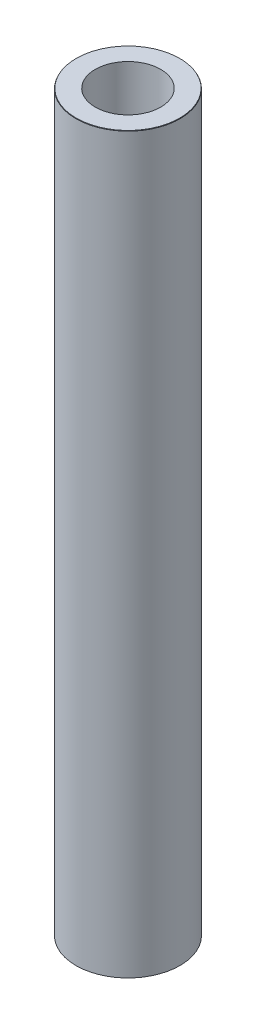
ISO-10303-21;
HEADER;
FILE_DESCRIPTION(('STEP AP214'),'2;1');
FILE_NAME('part.step','',(''),(''),'','','');
FILE_SCHEMA(('AUTOMOTIVE_DESIGN { 1 0 10303 214 1 1 1 1 }'));
ENDSEC;
DATA;
#1=APPLICATION_CONTEXT('core data for automotive mechanical design processes');
#2=APPLICATION_PROTOCOL_DEFINITION('international standard','automotive_design',2000,#1);
#3=PRODUCT_CONTEXT('',#1,'mechanical');
#4=PRODUCT('Part','Part','',(#3));
#5=PRODUCT_RELATED_PRODUCT_CATEGORY('part','',(#4));
#6=PRODUCT_DEFINITION_FORMATION('','',#4);
#7=PRODUCT_DEFINITION_CONTEXT('part definition',#1,'design');
#8=PRODUCT_DEFINITION('design','',#6,#7);
#9=PRODUCT_DEFINITION_SHAPE('','',#8);
#10=(LENGTH_UNIT() NAMED_UNIT(*) SI_UNIT(.MILLI.,.METRE.));
#11=(NAMED_UNIT(*) PLANE_ANGLE_UNIT() SI_UNIT($,.RADIAN.));
#12=(NAMED_UNIT(*) SI_UNIT($,.STERADIAN.) SOLID_ANGLE_UNIT());
#13=UNCERTAINTY_MEASURE_WITH_UNIT(LENGTH_MEASURE(1.E-05),#10,'distance_accuracy_value','');
#14=(GEOMETRIC_REPRESENTATION_CONTEXT(3) GLOBAL_UNCERTAINTY_ASSIGNED_CONTEXT((#13)) GLOBAL_UNIT_ASSIGNED_CONTEXT((#10,
#11,#12)) REPRESENTATION_CONTEXT('',''));
#15=CARTESIAN_POINT('',(0.,0.,0.));
#16=DIRECTION('',(0.,0.,1.));
#17=DIRECTION('',(1.,0.,0.));
#18=AXIS2_PLACEMENT_3D('',#15,#16,#17);
#19=CARTESIAN_POINT('',(0.,600.,0.));
#20=DIRECTION('',(0.,-1.,0.));
#21=DIRECTION('',(0.,0.,-1.));
#22=AXIS2_PLACEMENT_3D('',#19,#20,#21);
#23=CYLINDRICAL_SURFACE('',#22,42.5);
#24=CARTESIAN_POINT('',(0.,599.632017225866,0.));
#25=DIRECTION('',(0.,1.,0.));
#26=DIRECTION('',(0.,0.,1.));
#27=AXIS2_PLACEMENT_3D('',#24,#25,#26);
#28=CIRCLE('',#27,42.5);
#29=CARTESIAN_POINT('',(0.,599.632017225866,42.5));
#30=VERTEX_POINT('',#29);
#31=EDGE_CURVE('E50',#30,#30,#28,.F.);
#32=ORIENTED_EDGE('',*,*,#31,.T.);
#33=EDGE_LOOP('',(#32));
#34=FACE_BOUND('',#33,.T.);
#35=CARTESIAN_POINT('',(0.,0.212454953703367,0.));
#36=DIRECTION('',(0.,1.,0.));
#37=DIRECTION('',(0.,0.,1.));
#38=AXIS2_PLACEMENT_3D('',#35,#36,#37);
#39=CIRCLE('',#38,42.5);
#40=CARTESIAN_POINT('',(0.,0.212454953703367,42.5));
#41=VERTEX_POINT('',#40);
#42=EDGE_CURVE('E51',#41,#41,#39,.T.);
#43=ORIENTED_EDGE('',*,*,#42,.T.);
#44=EDGE_LOOP('',(#43));
#45=FACE_BOUND('',#44,.T.);
#46=ADVANCED_FACE('F39',(#34,#45),#23,.T.);
#47=CARTESIAN_POINT('',(0.,600.,0.));
#48=DIRECTION('',(0.,1.,0.));
#49=DIRECTION('',(0.,0.,1.));
#50=AXIS2_PLACEMENT_3D('',#47,#48,#49);
#51=PLANE('',#50);
#52=CARTESIAN_POINT('',(0.,600.,0.));
#53=DIRECTION('',(0.,1.,0.));
#54=DIRECTION('',(0.,0.,1.));
#55=AXIS2_PLACEMENT_3D('',#52,#53,#54);
#56=CIRCLE('',#55,42.2875450462966);
#57=CARTESIAN_POINT('',(0.,600.,42.2875450462966));
#58=VERTEX_POINT('',#57);
#59=EDGE_CURVE('E54',#58,#58,#56,.T.);
#60=ORIENTED_EDGE('',*,*,#59,.T.);
#61=EDGE_LOOP('',(#60));
#62=FACE_BOUND('',#61,.T.);
#63=CARTESIAN_POINT('',(0.,600.,0.));
#64=DIRECTION('',(0.,1.,0.));
#65=DIRECTION('',(0.,0.,1.));
#66=AXIS2_PLACEMENT_3D('',#63,#64,#65);
#67=CIRCLE('',#66,26.755728637514);
#68=CARTESIAN_POINT('',(0.,600.,26.755728637514));
#69=VERTEX_POINT('',#68);
#70=EDGE_CURVE('E58',#69,#69,#67,.T.);
#71=ORIENTED_EDGE('',*,*,#70,.F.);
#72=EDGE_LOOP('',(#71));
#73=FACE_BOUND('',#72,.T.);
#74=ADVANCED_FACE('F69',(#62,#73),#51,.T.);
#75=CARTESIAN_POINT('',(0.,0.,0.));
#76=DIRECTION('',(0.,1.,0.));
#77=DIRECTION('',(0.,0.,1.));
#78=AXIS2_PLACEMENT_3D('',#75,#76,#77);
#79=PLANE('',#78);
#80=CARTESIAN_POINT('',(0.,0.,0.));
#81=DIRECTION('',(0.,1.,0.));
#82=DIRECTION('',(0.,0.,1.));
#83=AXIS2_PLACEMENT_3D('',#80,#81,#82);
#84=CIRCLE('',#83,42.1320172258661);
#85=CARTESIAN_POINT('',(0.,0.,42.1320172258661));
#86=VERTEX_POINT('',#85);
#87=EDGE_CURVE('E10',#86,#86,#84,.F.);
#88=ORIENTED_EDGE('',*,*,#87,.T.);
#89=EDGE_LOOP('',(#88));
#90=FACE_BOUND('',#89,.T.);
#91=CARTESIAN_POINT('',(0.,0.,0.));
#92=DIRECTION('',(0.,1.,0.));
#93=DIRECTION('',(0.,0.,1.));
#94=AXIS2_PLACEMENT_3D('',#91,#92,#93);
#95=CIRCLE('',#94,26.755728637514);
#96=CARTESIAN_POINT('',(0.,0.,26.755728637514));
#97=VERTEX_POINT('',#96);
#98=EDGE_CURVE('E63',#97,#97,#95,.T.);
#99=ORIENTED_EDGE('',*,*,#98,.T.);
#100=EDGE_LOOP('',(#99));
#101=FACE_BOUND('',#100,.T.);
#102=ADVANCED_FACE('F75',(#90,#101),#79,.F.);
#103=CARTESIAN_POINT('',(0.,600.,0.));
#104=DIRECTION('',(0.,-1.,0.));
#105=DIRECTION('',(0.,0.,-1.));
#106=AXIS2_PLACEMENT_3D('',#103,#104,#105);
#107=CYLINDRICAL_SURFACE('',#106,26.755728637514);
#108=ORIENTED_EDGE('',*,*,#70,.T.);
#109=EDGE_LOOP('',(#108));
#110=FACE_BOUND('',#109,.T.);
#111=ORIENTED_EDGE('',*,*,#98,.F.);
#112=EDGE_LOOP('',(#111));
#113=FACE_BOUND('',#112,.T.);
#114=ADVANCED_FACE('F70',(#110,#113),#107,.F.);
#115=CARTESIAN_POINT('',(0.,600.,0.));
#116=DIRECTION('',(0.,-1.,0.));
#117=DIRECTION('',(0.,0.,-1.));
#118=AXIS2_PLACEMENT_3D('',#115,#116,#117);
#119=CONICAL_SURFACE('',#118,42.2875450462966,0.523598775598288);
#120=ORIENTED_EDGE('',*,*,#31,.F.);
#121=EDGE_LOOP('',(#120));
#122=FACE_BOUND('',#121,.T.);
#123=ORIENTED_EDGE('',*,*,#59,.F.);
#124=EDGE_LOOP('',(#123));
#125=FACE_BOUND('',#124,.T.);
#126=ADVANCED_FACE('F81',(#122,#125),#119,.T.);
#127=CARTESIAN_POINT('',(0.,0.212454953703367,0.));
#128=DIRECTION('',(0.,1.,0.));
#129=DIRECTION('',(0.,0.,1.));
#130=AXIS2_PLACEMENT_3D('',#127,#128,#129);
#131=CONICAL_SURFACE('',#130,42.5,1.04719755119662);
#132=ORIENTED_EDGE('',*,*,#87,.F.);
#133=EDGE_LOOP('',(#132));
#134=FACE_BOUND('',#133,.T.);
#135=ORIENTED_EDGE('',*,*,#42,.F.);
#136=EDGE_LOOP('',(#135));
#137=FACE_BOUND('',#136,.T.);
#138=ADVANCED_FACE('F45',(#134,#137),#131,.T.);
#139=CLOSED_SHELL('',(#46,#74,#102,#114,#126,#138));
#140=MANIFOLD_SOLID_BREP('B2',#139);
#141=ADVANCED_BREP_SHAPE_REPRESENTATION('',(#18,#140),#14);
#142=SHAPE_DEFINITION_REPRESENTATION(#9,#141);
ENDSEC;
END-ISO-10303-21;
